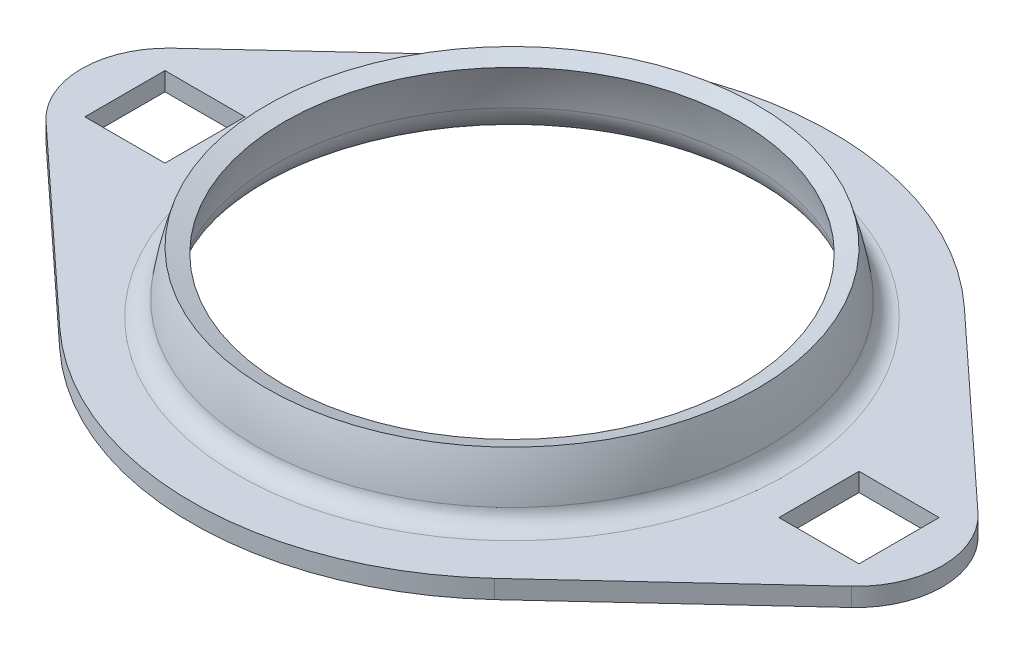
ISO-10303-21;
HEADER;
FILE_DESCRIPTION(('STEP AP214'),'2;1');
FILE_NAME('part.step','',(''),(''),'','','');
FILE_SCHEMA(('AUTOMOTIVE_DESIGN { 1 0 10303 214 1 1 1 1 }'));
ENDSEC;
DATA;
#1=APPLICATION_CONTEXT('core data for automotive mechanical design processes');
#2=APPLICATION_PROTOCOL_DEFINITION('international standard','automotive_design',2000,#1);
#3=PRODUCT_CONTEXT('',#1,'mechanical');
#4=PRODUCT('Part','Part','',(#3));
#5=PRODUCT_RELATED_PRODUCT_CATEGORY('part','',(#4));
#6=PRODUCT_DEFINITION_FORMATION('','',#4);
#7=PRODUCT_DEFINITION_CONTEXT('part definition',#1,'design');
#8=PRODUCT_DEFINITION('design','',#6,#7);
#9=PRODUCT_DEFINITION_SHAPE('','',#8);
#10=(LENGTH_UNIT() NAMED_UNIT(*) SI_UNIT(.MILLI.,.METRE.));
#11=(NAMED_UNIT(*) PLANE_ANGLE_UNIT() SI_UNIT($,.RADIAN.));
#12=(NAMED_UNIT(*) SI_UNIT($,.STERADIAN.) SOLID_ANGLE_UNIT());
#13=UNCERTAINTY_MEASURE_WITH_UNIT(LENGTH_MEASURE(1.E-05),#10,'distance_accuracy_value','');
#14=(GEOMETRIC_REPRESENTATION_CONTEXT(3) GLOBAL_UNCERTAINTY_ASSIGNED_CONTEXT((#13)) GLOBAL_UNIT_ASSIGNED_CONTEXT((#10,
#11,#12)) REPRESENTATION_CONTEXT('',''));
#15=CARTESIAN_POINT('',(0.,0.,0.));
#16=DIRECTION('',(0.,0.,1.));
#17=DIRECTION('',(1.,0.,0.));
#18=AXIS2_PLACEMENT_3D('',#15,#16,#17);
#19=CARTESIAN_POINT('',(34.75,10.5,0.));
#20=DIRECTION('',(0.,1.,0.));
#21=DIRECTION('',(0.,0.,1.));
#22=AXIS2_PLACEMENT_3D('',#19,#20,#21);
#23=PLANE('',#22);
#24=DIRECTION('',(0.,0.,1.));
#25=VECTOR('',#24,1.);
#26=CARTESIAN_POINT('',(-42.0249999999999,10.5,0.));
#27=LINE('',#26,#25);
#28=CARTESIAN_POINT('',(-42.0249999999999,10.5,-4.35));
#29=VERTEX_POINT('',#28);
#30=CARTESIAN_POINT('',(-42.0249999999999,10.5,4.35));
#31=VERTEX_POINT('',#30);
#32=EDGE_CURVE('E243',#29,#31,#27,.T.);
#33=ORIENTED_EDGE('',*,*,#32,.F.);
#34=DIRECTION('',(-1.,0.,0.));
#35=VECTOR('',#34,1.);
#36=CARTESIAN_POINT('',(34.75,10.5,-4.35000000000002));
#37=LINE('',#36,#35);
#38=CARTESIAN_POINT('',(-33.3249999999999,10.5,-4.35));
#39=VERTEX_POINT('',#38);
#40=EDGE_CURVE('E237',#39,#29,#37,.T.);
#41=ORIENTED_EDGE('',*,*,#40,.F.);
#42=DIRECTION('',(0.,0.,1.));
#43=VECTOR('',#42,1.);
#44=CARTESIAN_POINT('',(-33.3249999999999,10.5,0.));
#45=LINE('',#44,#43);
#46=CARTESIAN_POINT('',(-33.3249999999999,10.5,4.35));
#47=VERTEX_POINT('',#46);
#48=EDGE_CURVE('E182',#39,#47,#45,.T.);
#49=ORIENTED_EDGE('',*,*,#48,.T.);
#50=DIRECTION('',(-1.,0.,0.));
#51=VECTOR('',#50,1.);
#52=CARTESIAN_POINT('',(34.75,10.5,4.35));
#53=LINE('',#52,#51);
#54=EDGE_CURVE('E240',#47,#31,#53,.T.);
#55=ORIENTED_EDGE('',*,*,#54,.T.);
#56=EDGE_LOOP('',(#33,#41,#49,#55));
#57=FACE_BOUND('',#56,.T.);
#58=CARTESIAN_POINT('',(0.,10.5,0.));
#59=DIRECTION('',(0.,-1.,0.));
#60=DIRECTION('',(0.,0.,-1.));
#61=AXIS2_PLACEMENT_3D('',#58,#59,#60);
#62=CIRCLE('',#61,29.732137494637);
#63=CARTESIAN_POINT('',(0.,10.5,-29.732137494637));
#64=VERTEX_POINT('',#63);
#65=EDGE_CURVE('E297',#64,#64,#62,.T.);
#66=ORIENTED_EDGE('',*,*,#65,.T.);
#67=EDGE_LOOP('',(#66));
#68=FACE_BOUND('',#67,.T.);
#69=CARTESIAN_POINT('',(0.,10.5,0.));
#70=DIRECTION('',(0.,-1.,0.));
#71=DIRECTION('',(0.,0.,-1.));
#72=AXIS2_PLACEMENT_3D('',#69,#70,#71);
#73=CIRCLE('',#72,34.75);
#74=CARTESIAN_POINT('',(23.6149334236567,10.5,25.4930857174304));
#75=VERTEX_POINT('',#74);
#76=CARTESIAN_POINT('',(-23.6149334236569,10.5,25.4930857174304));
#77=VERTEX_POINT('',#76);
#78=EDGE_CURVE('E12',#75,#77,#73,.T.);
#79=ORIENTED_EDGE('',*,*,#78,.F.);
#80=DIRECTION('',(0.733613977480021,0.,-0.679566429457741));
#81=VECTOR('',#80,1.);
#82=CARTESIAN_POINT('',(23.6149334236567,10.5,25.4930857174304));
#83=LINE('',#82,#81);
#84=CARTESIAN_POINT('',(43.7277414164133,10.5,6.86204877759941));
#85=VERTEX_POINT('',#84);
#86=EDGE_CURVE('E258',#75,#85,#83,.T.);
#87=ORIENTED_EDGE('',*,*,#86,.T.);
#88=CARTESIAN_POINT('',(37.3712404094721,10.5,4.44089209850063E-13));
#89=DIRECTION('',(0.,1.,0.));
#90=DIRECTION('',(0.,0.,1.));
#91=AXIS2_PLACEMENT_3D('',#88,#89,#90);
#92=CIRCLE('',#91,9.35375959052785);
#93=CARTESIAN_POINT('',(43.7277414164133,10.5,-6.86204877759865));
#94=VERTEX_POINT('',#93);
#95=EDGE_CURVE('E277',#85,#94,#92,.T.);
#96=ORIENTED_EDGE('',*,*,#95,.T.);
#97=DIRECTION('',(0.733613977480009,0.,0.679566429457755));
#98=VECTOR('',#97,1.);
#99=CARTESIAN_POINT('',(23.6149334236571,10.5,-25.4930857174302));
#100=LINE('',#99,#98);
#101=CARTESIAN_POINT('',(23.6149334236571,10.5,-25.4930857174302));
#102=VERTEX_POINT('',#101);
#103=EDGE_CURVE('E254',#102,#94,#100,.T.);
#104=ORIENTED_EDGE('',*,*,#103,.F.);
#105=CARTESIAN_POINT('',(-23.6149334236569,10.5,-25.4930857174304));
#106=VERTEX_POINT('',#105);
#107=EDGE_CURVE('E72',#106,#102,#73,.T.);
#108=ORIENTED_EDGE('',*,*,#107,.F.);
#109=DIRECTION('',(-0.733613977480011,0.,0.679566429457752));
#110=VECTOR('',#109,1.);
#111=CARTESIAN_POINT('',(-23.6149334236569,10.5,-25.4930857174304));
#112=LINE('',#111,#110);
#113=CARTESIAN_POINT('',(-43.7277414164133,10.5,-6.86204877759888));
#114=VERTEX_POINT('',#113);
#115=EDGE_CURVE('E279',#106,#114,#112,.T.);
#116=ORIENTED_EDGE('',*,*,#115,.T.);
#117=CARTESIAN_POINT('',(-37.3712404094721,10.5,0.));
#118=DIRECTION('',(0.,1.,0.));
#119=DIRECTION('',(0.,0.,1.));
#120=AXIS2_PLACEMENT_3D('',#117,#118,#119);
#121=CIRCLE('',#120,9.35375959052777);
#122=CARTESIAN_POINT('',(-43.7277414164133,10.5,6.86204877759888));
#123=VERTEX_POINT('',#122);
#124=EDGE_CURVE('E263',#123,#114,#121,.F.);
#125=ORIENTED_EDGE('',*,*,#124,.F.);
#126=DIRECTION('',(-0.733613977480011,0.,-0.679566429457752));
#127=VECTOR('',#126,1.);
#128=CARTESIAN_POINT('',(-23.6149334236569,10.5,25.4930857174304));
#129=LINE('',#128,#127);
#130=EDGE_CURVE('E245',#77,#123,#129,.T.);
#131=ORIENTED_EDGE('',*,*,#130,.F.);
#132=EDGE_LOOP('',(#79,#87,#96,#104,#108,#116,#125,#131));
#133=FACE_BOUND('',#132,.T.);
#134=DIRECTION('',(1.,0.,0.));
#135=VECTOR('',#134,1.);
#136=CARTESIAN_POINT('',(34.75,10.5,-4.34999999999978));
#137=LINE('',#136,#135);
#138=CARTESIAN_POINT('',(33.3249999999999,10.5,-4.34999999999978));
#139=VERTEX_POINT('',#138);
#140=CARTESIAN_POINT('',(42.0249999999999,10.5,-4.34999999999978));
#141=VERTEX_POINT('',#140);
#142=EDGE_CURVE('E231',#139,#141,#137,.T.);
#143=ORIENTED_EDGE('',*,*,#142,.T.);
#144=DIRECTION('',(0.,0.,1.));
#145=VECTOR('',#144,1.);
#146=CARTESIAN_POINT('',(42.0249999999999,10.5,0.));
#147=LINE('',#146,#145);
#148=CARTESIAN_POINT('',(42.0249999999999,10.5,4.35000000000044));
#149=VERTEX_POINT('',#148);
#150=EDGE_CURVE('E234',#141,#149,#147,.T.);
#151=ORIENTED_EDGE('',*,*,#150,.T.);
#152=DIRECTION('',(1.,0.,0.));
#153=VECTOR('',#152,1.);
#154=CARTESIAN_POINT('',(34.75,10.5,4.35000000000044));
#155=LINE('',#154,#153);
#156=CARTESIAN_POINT('',(33.3249999999999,10.5,4.35000000000044));
#157=VERTEX_POINT('',#156);
#158=EDGE_CURVE('E206',#157,#149,#155,.T.);
#159=ORIENTED_EDGE('',*,*,#158,.F.);
#160=DIRECTION('',(0.,0.,1.));
#161=VECTOR('',#160,1.);
#162=CARTESIAN_POINT('',(33.3249999999999,10.5,0.));
#163=LINE('',#162,#161);
#164=EDGE_CURVE('E229',#139,#157,#163,.T.);
#165=ORIENTED_EDGE('',*,*,#164,.F.);
#166=EDGE_LOOP('',(#143,#151,#159,#165));
#167=FACE_BOUND('',#166,.T.);
#168=ADVANCED_FACE('F63',(#57,#68,#133,#167),#23,.T.);
#169=CARTESIAN_POINT('',(34.75,8.49999999999998,0.));
#170=DIRECTION('',(0.,1.,0.));
#171=DIRECTION('',(0.,0.,1.));
#172=AXIS2_PLACEMENT_3D('',#169,#170,#171);
#173=PLANE('',#172);
#174=DIRECTION('',(1.,0.,0.));
#175=VECTOR('',#174,1.);
#176=CARTESIAN_POINT('',(-42.0249999999999,8.49999999999998,-4.35));
#177=LINE('',#176,#175);
#178=CARTESIAN_POINT('',(-42.0249999999999,8.49999999999998,-4.35));
#179=VERTEX_POINT('',#178);
#180=CARTESIAN_POINT('',(-33.3249999999999,8.49999999999998,-4.35));
#181=VERTEX_POINT('',#180);
#182=EDGE_CURVE('E189',#179,#181,#177,.T.);
#183=ORIENTED_EDGE('',*,*,#182,.F.);
#184=DIRECTION('',(0.,0.,-1.));
#185=VECTOR('',#184,1.);
#186=CARTESIAN_POINT('',(-42.0249999999999,8.49999999999998,4.35));
#187=LINE('',#186,#185);
#188=CARTESIAN_POINT('',(-42.0249999999999,8.49999999999998,4.35));
#189=VERTEX_POINT('',#188);
#190=EDGE_CURVE('E194',#189,#179,#187,.T.);
#191=ORIENTED_EDGE('',*,*,#190,.F.);
#192=DIRECTION('',(1.,0.,0.));
#193=VECTOR('',#192,1.);
#194=CARTESIAN_POINT('',(-42.0249999999999,8.49999999999998,4.35));
#195=LINE('',#194,#193);
#196=CARTESIAN_POINT('',(-33.3249999999999,8.49999999999998,4.35));
#197=VERTEX_POINT('',#196);
#198=EDGE_CURVE('E199',#189,#197,#195,.T.);
#199=ORIENTED_EDGE('',*,*,#198,.T.);
#200=DIRECTION('',(0.,0.,-1.));
#201=VECTOR('',#200,1.);
#202=CARTESIAN_POINT('',(-33.3249999999999,8.49999999999998,4.35));
#203=LINE('',#202,#201);
#204=EDGE_CURVE('E179',#197,#181,#203,.T.);
#205=ORIENTED_EDGE('',*,*,#204,.T.);
#206=EDGE_LOOP('',(#183,#191,#199,#205));
#207=FACE_BOUND('',#206,.T.);
#208=CARTESIAN_POINT('',(0.,8.49999999999995,0.));
#209=DIRECTION('',(0.,-1.,0.));
#210=DIRECTION('',(0.,0.,-1.));
#211=AXIS2_PLACEMENT_3D('',#208,#209,#210);
#212=CIRCLE('',#211,34.75);
#213=CARTESIAN_POINT('',(-23.6149334236569,8.49999999999995,-25.4930857174304));
#214=VERTEX_POINT('',#213);
#215=CARTESIAN_POINT('',(23.6149334236571,8.49999999999995,-25.4930857174302));
#216=VERTEX_POINT('',#215);
#217=EDGE_CURVE('E67',#214,#216,#212,.T.);
#218=ORIENTED_EDGE('',*,*,#217,.T.);
#219=DIRECTION('',(0.733613977480009,0.,0.679566429457755));
#220=VECTOR('',#219,1.);
#221=CARTESIAN_POINT('',(23.6149334236571,8.49999999999998,-25.4930857174302));
#222=LINE('',#221,#220);
#223=CARTESIAN_POINT('',(43.7277414164133,8.49999999999998,-6.86204877759866));
#224=VERTEX_POINT('',#223);
#225=EDGE_CURVE('E255',#216,#224,#222,.T.);
#226=ORIENTED_EDGE('',*,*,#225,.T.);
#227=CARTESIAN_POINT('',(37.3712404094721,8.49999999999998,4.44089209850063E-13));
#228=DIRECTION('',(0.,1.,0.));
#229=DIRECTION('',(0.,0.,1.));
#230=AXIS2_PLACEMENT_3D('',#227,#228,#229);
#231=CIRCLE('',#230,9.35375959052785);
#232=CARTESIAN_POINT('',(43.7277414164133,8.49999999999998,6.86204877759941));
#233=VERTEX_POINT('',#232);
#234=EDGE_CURVE('E251',#233,#224,#231,.T.);
#235=ORIENTED_EDGE('',*,*,#234,.F.);
#236=DIRECTION('',(0.733613977480021,0.,-0.679566429457741));
#237=VECTOR('',#236,1.);
#238=CARTESIAN_POINT('',(23.6149334236567,8.49999999999998,25.4930857174304));
#239=LINE('',#238,#237);
#240=CARTESIAN_POINT('',(23.6149334236564,8.49999999999995,25.4930857174306));
#241=VERTEX_POINT('',#240);
#242=EDGE_CURVE('E246',#241,#233,#239,.T.);
#243=ORIENTED_EDGE('',*,*,#242,.F.);
#244=CARTESIAN_POINT('',(-23.6149334236569,8.49999999999995,25.4930857174304));
#245=VERTEX_POINT('',#244);
#246=EDGE_CURVE('E303',#241,#245,#212,.T.);
#247=ORIENTED_EDGE('',*,*,#246,.T.);
#248=DIRECTION('',(-0.733613977480011,0.,-0.679566429457752));
#249=VECTOR('',#248,1.);
#250=CARTESIAN_POINT('',(-23.6149334236569,8.49999999999998,25.4930857174304));
#251=LINE('',#250,#249);
#252=CARTESIAN_POINT('',(-43.7277414164133,8.49999999999998,6.86204877759888));
#253=VERTEX_POINT('',#252);
#254=EDGE_CURVE('E267',#245,#253,#251,.T.);
#255=ORIENTED_EDGE('',*,*,#254,.T.);
#256=CARTESIAN_POINT('',(-37.3712404094721,8.49999999999998,0.));
#257=DIRECTION('',(0.,-1.,0.));
#258=DIRECTION('',(0.,0.,-1.));
#259=AXIS2_PLACEMENT_3D('',#256,#257,#258);
#260=CIRCLE('',#259,9.35375959052777);
#261=CARTESIAN_POINT('',(-43.7277414164133,8.49999999999998,-6.86204877759888));
#262=VERTEX_POINT('',#261);
#263=EDGE_CURVE('E259',#253,#262,#260,.T.);
#264=ORIENTED_EDGE('',*,*,#263,.T.);
#265=DIRECTION('',(-0.733613977480011,0.,0.679566429457752));
#266=VECTOR('',#265,1.);
#267=CARTESIAN_POINT('',(-23.6149334236569,8.49999999999998,-25.4930857174304));
#268=LINE('',#267,#266);
#269=EDGE_CURVE('E260',#214,#262,#268,.T.);
#270=ORIENTED_EDGE('',*,*,#269,.F.);
#271=EDGE_LOOP('',(#218,#226,#235,#243,#247,#255,#264,#270));
#272=FACE_BOUND('',#271,.T.);
#273=CARTESIAN_POINT('',(0.,8.49999999999999,0.));
#274=DIRECTION('',(0.,-1.,0.));
#275=DIRECTION('',(0.,0.,-1.));
#276=AXIS2_PLACEMENT_3D('',#273,#274,#275);
#277=CIRCLE('',#276,29.732137494637);
#278=CARTESIAN_POINT('',(0.,8.49999999999999,-29.732137494637));
#279=VERTEX_POINT('',#278);
#280=EDGE_CURVE('E310',#279,#279,#277,.T.);
#281=ORIENTED_EDGE('',*,*,#280,.F.);
#282=EDGE_LOOP('',(#281));
#283=FACE_BOUND('',#282,.T.);
#284=DIRECTION('',(0.,0.,-1.));
#285=VECTOR('',#284,1.);
#286=CARTESIAN_POINT('',(42.0249999999999,8.49999999999998,4.35000000000044));
#287=LINE('',#286,#285);
#288=CARTESIAN_POINT('',(42.0249999999999,8.49999999999998,4.35000000000044));
#289=VERTEX_POINT('',#288);
#290=CARTESIAN_POINT('',(42.0249999999999,8.49999999999998,-4.34999999999978));
#291=VERTEX_POINT('',#290);
#292=EDGE_CURVE('E225',#289,#291,#287,.T.);
#293=ORIENTED_EDGE('',*,*,#292,.T.);
#294=DIRECTION('',(-1.,0.,0.));
#295=VECTOR('',#294,1.);
#296=CARTESIAN_POINT('',(42.0249999999999,8.49999999999998,-4.34999999999978));
#297=LINE('',#296,#295);
#298=CARTESIAN_POINT('',(33.3249999999999,8.49999999999998,-4.34999999999978));
#299=VERTEX_POINT('',#298);
#300=EDGE_CURVE('E222',#291,#299,#297,.T.);
#301=ORIENTED_EDGE('',*,*,#300,.T.);
#302=DIRECTION('',(0.,0.,-1.));
#303=VECTOR('',#302,1.);
#304=CARTESIAN_POINT('',(33.3249999999999,8.49999999999998,4.35000000000044));
#305=LINE('',#304,#303);
#306=CARTESIAN_POINT('',(33.3249999999999,8.49999999999998,4.35000000000044));
#307=VERTEX_POINT('',#306);
#308=EDGE_CURVE('E219',#307,#299,#305,.T.);
#309=ORIENTED_EDGE('',*,*,#308,.F.);
#310=DIRECTION('',(-1.,0.,0.));
#311=VECTOR('',#310,1.);
#312=CARTESIAN_POINT('',(42.0249999999999,8.49999999999998,4.35000000000044));
#313=LINE('',#312,#311);
#314=EDGE_CURVE('E217',#289,#307,#313,.T.);
#315=ORIENTED_EDGE('',*,*,#314,.F.);
#316=EDGE_LOOP('',(#293,#301,#309,#315));
#317=FACE_BOUND('',#316,.T.);
#318=ADVANCED_FACE('F196',(#207,#272,#283,#317),#173,.F.);
#319=CARTESIAN_POINT('',(0.,8.49999999999995,0.));
#320=DIRECTION('',(0.,1.,0.));
#321=DIRECTION('',(0.,0.,1.));
#322=AXIS2_PLACEMENT_3D('',#319,#320,#321);
#323=CYLINDRICAL_SURFACE('',#322,34.75);
#324=ORIENTED_EDGE('',*,*,#78,.T.);
#325=DIRECTION('',(0.,-1.,0.));
#326=VECTOR('',#325,1.);
#327=CARTESIAN_POINT('',(-23.6149334236568,126.960948390437,25.4930857174303));
#328=LINE('',#327,#326);
#329=EDGE_CURVE('E285',#77,#245,#328,.T.);
#330=ORIENTED_EDGE('',*,*,#329,.T.);
#331=ORIENTED_EDGE('',*,*,#246,.F.);
#332=DIRECTION('',(0.,-1.,0.));
#333=VECTOR('',#332,1.);
#334=CARTESIAN_POINT('',(23.6149334236567,126.960948390437,25.4930857174304));
#335=LINE('',#334,#333);
#336=EDGE_CURVE('E250',#75,#241,#335,.T.);
#337=ORIENTED_EDGE('',*,*,#336,.F.);
#338=EDGE_LOOP('',(#324,#330,#331,#337));
#339=FACE_BOUND('',#338,.T.);
#340=ADVANCED_FACE('F352',(#339),#323,.T.);
#341=ORIENTED_EDGE('',*,*,#107,.T.);
#342=DIRECTION('',(0.,-1.,0.));
#343=VECTOR('',#342,1.);
#344=CARTESIAN_POINT('',(23.6149334236571,126.960948390437,-25.4930857174302));
#345=LINE('',#344,#343);
#346=EDGE_CURVE('E291',#102,#216,#345,.T.);
#347=ORIENTED_EDGE('',*,*,#346,.T.);
#348=ORIENTED_EDGE('',*,*,#217,.F.);
#349=DIRECTION('',(0.,-1.,0.));
#350=VECTOR('',#349,1.);
#351=CARTESIAN_POINT('',(-23.6149334236569,126.960948390437,-25.4930857174304));
#352=LINE('',#351,#350);
#353=EDGE_CURVE('E264',#106,#214,#352,.T.);
#354=ORIENTED_EDGE('',*,*,#353,.F.);
#355=EDGE_LOOP('',(#341,#347,#348,#354));
#356=FACE_BOUND('',#355,.T.);
#357=ADVANCED_FACE('F339',(#356),#323,.T.);
#358=CARTESIAN_POINT('',(0.,16.5,0.));
#359=DIRECTION('',(0.,1.,0.));
#360=DIRECTION('',(0.,0.,1.));
#361=AXIS2_PLACEMENT_3D('',#358,#359,#360);
#362=CONICAL_SURFACE('',#361,24.7386337537059,1.25802960485335);
#363=CARTESIAN_POINT('',(0.,17.1153846153846,0.));
#364=DIRECTION('',(0.,-1.,0.));
#365=DIRECTION('',(0.,0.,-1.));
#366=AXIS2_PLACEMENT_3D('',#363,#364,#365);
#367=CIRCLE('',#366,26.6416055809141);
#368=CARTESIAN_POINT('',(26.6416055809141,17.1153846153846,0.));
#369=VERTEX_POINT('',#368);
#370=EDGE_CURVE('E300',#369,#369,#367,.T.);
#371=ORIENTED_EDGE('',*,*,#370,.F.);
#372=EDGE_LOOP('',(#371));
#373=FACE_BOUND('',#372,.T.);
#374=CARTESIAN_POINT('',(0.,16.5,0.));
#375=DIRECTION('',(0.,-1.,0.));
#376=DIRECTION('',(0.,0.,-1.));
#377=AXIS2_PLACEMENT_3D('',#374,#375,#376);
#378=CIRCLE('',#377,24.7386337537059);
#379=CARTESIAN_POINT('',(24.7386337537059,16.5,0.));
#380=VERTEX_POINT('',#379);
#381=EDGE_CURVE('E307',#380,#380,#378,.T.);
#382=ORIENTED_EDGE('',*,*,#381,.T.);
#383=EDGE_LOOP('',(#382));
#384=FACE_BOUND('',#383,.T.);
#385=ADVANCED_FACE('F65',(#373,#384),#362,.F.);
#386=CARTESIAN_POINT('',(0.,12.5,0.));
#387=DIRECTION('',(0.,-1.,0.));
#388=DIRECTION('',(0.,0.,-1.));
#389=AXIS2_PLACEMENT_3D('',#386,#387,#388);
#390=TOROIDAL_SURFACE('',#389,29.732137494637,2.);
#391=CARTESIAN_POINT('',(0.,12.2333333333333,0.));
#392=DIRECTION('',(0.,-1.,0.));
#393=DIRECTION('',(0.,0.,-1.));
#394=AXIS2_PLACEMENT_3D('',#391,#392,#393);
#395=CIRCLE('',#394,27.7499949949945);
#396=CARTESIAN_POINT('',(27.7499949949945,12.2333333333333,0.));
#397=VERTEX_POINT('',#396);
#398=EDGE_CURVE('E301',#397,#397,#395,.T.);
#399=ORIENTED_EDGE('',*,*,#398,.T.);
#400=EDGE_LOOP('',(#399));
#401=FACE_BOUND('',#400,.T.);
#402=ORIENTED_EDGE('',*,*,#65,.F.);
#403=EDGE_LOOP('',(#402));
#404=FACE_BOUND('',#403,.T.);
#405=ADVANCED_FACE('F400',(#401,#404),#390,.F.);
#406=CARTESIAN_POINT('',(0.,8.5,0.));
#407=DIRECTION('',(0.,-1.,0.));
#408=DIRECTION('',(1.,0.,0.));
#409=AXIS2_PLACEMENT_3D('',#406,#407,#408);
#410=SPHERICAL_SURFACE('',#409,28.);
#411=CARTESIAN_POINT('',(26.6416055809141,17.1153846153846,0.));
#412=CARTESIAN_POINT('',(26.6576728379628,17.0656993722769,0.));
#413=CARTESIAN_POINT('',(26.6736011012478,17.0159691812667,0.));
#414=CARTESIAN_POINT('',(26.7051791485745,16.9164204622886,0.));
#415=CARTESIAN_POINT('',(26.7208289326164,16.8666019343208,0.));
#416=CARTESIAN_POINT('',(26.7518495297415,16.7668781002746,0.));
#417=CARTESIAN_POINT('',(26.7672203428249,16.7169727941963,0.));
#418=CARTESIAN_POINT('',(26.7976825173857,16.6170769662338,0.));
#419=CARTESIAN_POINT('',(26.8127738788632,16.5670864443496,0.));
#420=CARTESIAN_POINT('',(26.8426766776867,16.4670217495486,0.));
#421=CARTESIAN_POINT('',(26.8574881150326,16.4169475766319,0.));
#422=CARTESIAN_POINT('',(26.8868306019973,16.316717147211,0.));
#423=CARTESIAN_POINT('',(26.901361651616,16.2665608907069,0.));
#424=CARTESIAN_POINT('',(26.9301429082623,16.1661678641114,0.));
#425=CARTESIAN_POINT('',(26.9443931152898,16.1159310940201,0.));
#426=CARTESIAN_POINT('',(26.9726122406928,16.0153786127745,0.));
#427=CARTESIAN_POINT('',(26.9865811590683,15.9650629016203,0.));
#428=CARTESIAN_POINT('',(27.014237269908,15.8643541132433,0.));
#429=CARTESIAN_POINT('',(27.0279244623723,15.8139610360205,0.));
#430=CARTESIAN_POINT('',(27.0550166929501,15.7130990929227,0.));
#431=CARTESIAN_POINT('',(27.0684217310635,15.6626302270477,0.));
#432=CARTESIAN_POINT('',(27.0949492333319,15.561618286434,0.));
#433=CARTESIAN_POINT('',(27.1080716974867,15.5110752116953,0.));
#434=CARTESIAN_POINT('',(27.1340336410754,15.4099164354658,0.));
#435=CARTESIAN_POINT('',(27.1468731205091,15.359300733975,0.));
#436=CARTESIAN_POINT('',(27.172268692751,15.2579982886262,0.));
#437=CARTESIAN_POINT('',(27.1848247855591,15.2073115447682,0.));
#438=CARTESIAN_POINT('',(27.2096531915159,15.1058686012936,0.));
#439=CARTESIAN_POINT('',(27.2219255046646,15.055112401677,0.));
#440=CARTESIAN_POINT('',(27.2461859671516,14.9535321354682,0.));
#441=CARTESIAN_POINT('',(27.2581741164899,14.9027080688759,0.));
#442=CARTESIAN_POINT('',(27.2818658761003,14.8009936596228,0.));
#443=CARTESIAN_POINT('',(27.2935694863723,14.7501033169619,0.));
#444=CARTESIAN_POINT('',(27.3166918015007,14.6482579485535,0.));
#445=CARTESIAN_POINT('',(27.3281105063572,14.597302922806,0.));
#446=CARTESIAN_POINT('',(27.3506626532236,14.4953297832306,0.));
#447=CARTESIAN_POINT('',(27.3617960952334,14.4443116694027,0.));
#448=CARTESIAN_POINT('',(27.3837773679049,14.3422139506482,0.));
#449=CARTESIAN_POINT('',(27.3946251985665,14.2911343457214,0.));
#450=CARTESIAN_POINT('',(27.41603490898,14.1889152436751,0.));
#451=CARTESIAN_POINT('',(27.4265967887319,14.1377757465556,0.));
#452=CARTESIAN_POINT('',(27.4474342667155,14.0354384609045,0.));
#453=CARTESIAN_POINT('',(27.4577098649472,13.984240672373,0.));
#454=CARTESIAN_POINT('',(27.4779744582412,13.8817884065036,0.));
#455=CARTESIAN_POINT('',(27.4879634533034,13.8305339291657,0.));
#456=CARTESIAN_POINT('',(27.5076545275805,13.7279698900635,0.));
#457=CARTESIAN_POINT('',(27.5173566067953,13.6766603282992,0.));
#458=CARTESIAN_POINT('',(27.5364735456808,13.5739877264485,0.));
#459=CARTESIAN_POINT('',(27.5458884053515,13.5226246863621,0.));
#460=CARTESIAN_POINT('',(27.5644306104423,13.4198467356454,0.));
#461=CARTESIAN_POINT('',(27.5735579558624,13.3684318250152,0.));
#462=CARTESIAN_POINT('',(27.5915248467463,13.2655517426128,0.));
#463=CARTESIAN_POINT('',(27.6003643922102,13.2140865708408,0.));
#464=CARTESIAN_POINT('',(27.6177554064814,13.1111075771297,0.));
#465=CARTESIAN_POINT('',(27.6263068752888,13.0595937551906,0.));
#466=CARTESIAN_POINT('',(27.6431214685769,12.956519073645,0.));
#467=CARTESIAN_POINT('',(27.6513845930575,12.9049582140385,0.));
#468=CARTESIAN_POINT('',(27.667622239001,12.8017910711232,0.));
#469=CARTESIAN_POINT('',(27.6755967604637,12.7501847878145,0.));
#470=CARTESIAN_POINT('',(27.6912569508885,12.6469284129064,0.));
#471=CARTESIAN_POINT('',(27.6989426198504,12.5952783213071,0.));
#472=CARTESIAN_POINT('',(27.7140248641819,12.4919359465096,0.));
#473=CARTESIAN_POINT('',(27.7214214395515,12.4402436633114,0.));
#474=CARTESIAN_POINT('',(27.7359252670828,12.3368185236688,0.));
#475=CARTESIAN_POINT('',(27.7430325192445,12.2850856672244,0.));
#476=CARTESIAN_POINT('',(27.7499949949945,12.2333333333333,0.));
#477=B_SPLINE_CURVE_WITH_KNOTS('',3,(#411,#412,#413,#414,#415,#416,#417,#418,#419,#420,#421,
#422,#423,#424,#425,#426,#427,#428,#429,#430,#431,#432,#433,#434,#435,#436,#437,#438,#439,#440,
#441,#442,#443,#444,#445,#446,#447,#448,#449,#450,#451,#452,#453,#454,#455,#456,#457,#458,#459,
#460,#461,#462,#463,#464,#465,#466,#467,#468,#469,#470,#471,#472,#473,#474,#475,#476),
.UNSPECIFIED.,.F.,.F.,(4,2,2,2,2,2,2,2,2,2,2,2,2,2,2,2,2,2,2,2,2,2,2,2,2,2,2,2,2,2,2,2,4),(0.,
0.156655536644874,0.313311073289746,0.469966609934623,0.626622146579498,0.783277683224373,
0.939933219869248,1.09658875651412,1.253244293159,1.40989982980387,1.56655536644875,
1.72321090309362,1.8798664397385,2.03652197638337,2.19317751302825,2.34983304967312,
2.506488586318,2.66314412296287,2.81979965960775,2.97645519625262,3.1331107328975,
3.28976626954237,3.44642180618725,3.60307734283212,3.759732879477,3.91638841612187,
4.07304395276675,4.22969948941162,4.3863550260565,4.54301056270137,4.69966609934625,
4.85632163599112,5.012977172636),.UNSPECIFIED.);
#478=EDGE_CURVE('BSEAM403',#369,#397,#477,.T.);
#479=ORIENTED_EDGE('',*,*,#370,.T.);
#480=ORIENTED_EDGE('',*,*,#398,.F.);
#481=ORIENTED_EDGE('',*,*,#478,.T.);
#482=ORIENTED_EDGE('',*,*,#478,.F.);
#483=EDGE_LOOP('',(#479,#481,#480,#482));
#484=FACE_BOUND('',#483,.T.);
#485=ADVANCED_FACE('F403',(#484),#410,.T.);
#486=CARTESIAN_POINT('',(0.,12.5,0.));
#487=DIRECTION('',(0.,-1.,0.));
#488=DIRECTION('',(0.,0.,-1.));
#489=AXIS2_PLACEMENT_3D('',#486,#487,#488);
#490=TOROIDAL_SURFACE('',#489,29.732137494637,4.);
#491=CARTESIAN_POINT('',(0.,11.9666666666667,0.));
#492=DIRECTION('',(0.,-1.,0.));
#493=DIRECTION('',(0.,0.,-1.));
#494=AXIS2_PLACEMENT_3D('',#491,#492,#493);
#495=CIRCLE('',#494,25.7678524953521);
#496=CARTESIAN_POINT('',(25.7678524953521,11.9666666666667,0.));
#497=VERTEX_POINT('',#496);
#498=EDGE_CURVE('E284',#497,#497,#495,.T.);
#499=ORIENTED_EDGE('',*,*,#498,.F.);
#500=EDGE_LOOP('',(#499));
#501=FACE_BOUND('',#500,.T.);
#502=ORIENTED_EDGE('',*,*,#280,.T.);
#503=EDGE_LOOP('',(#502));
#504=FACE_BOUND('',#503,.T.);
#505=ADVANCED_FACE('F407',(#501,#504),#490,.T.);
#506=CARTESIAN_POINT('',(0.,8.5,0.));
#507=DIRECTION('',(0.,-1.,0.));
#508=DIRECTION('',(1.,0.,0.));
#509=AXIS2_PLACEMENT_3D('',#506,#507,#508);
#510=SPHERICAL_SURFACE('',#509,26.);
#511=CARTESIAN_POINT('',(24.7386337537059,16.5,0.));
#512=CARTESIAN_POINT('',(24.7535533495369,16.4538637028285,0.));
#513=CARTESIAN_POINT('',(24.7683438797301,16.4076856683191,0.));
#514=CARTESIAN_POINT('',(24.7976663522478,16.3152475721252,0.));
#515=CARTESIAN_POINT('',(24.8121982945723,16.2689875104407,0.));
#516=CARTESIAN_POINT('',(24.84100313476,16.1763868073978,0.));
#517=CARTESIAN_POINT('',(24.8552760326231,16.1300461660394,0.));
#518=CARTESIAN_POINT('',(24.8835623375724,16.0372857543599,0.));
#519=CARTESIAN_POINT('',(24.8975757446587,15.9908659840389,0.));
#520=CARTESIAN_POINT('',(24.9253426292805,15.897948767438,0.));
#521=CARTESIAN_POINT('',(24.939096106816,15.8514513211582,0.));
#522=CARTESIAN_POINT('',(24.9663427018547,15.7583802081245,0.));
#523=CARTESIAN_POINT('',(24.9798358193578,15.7118065413707,0.));
#524=CARTESIAN_POINT('',(25.0065612719578,15.6185844452463,0.));
#525=CARTESIAN_POINT('',(25.0197936070548,15.5719360158758,0.));
#526=CARTESIAN_POINT('',(25.0459970806433,15.4785658547192,0.));
#527=CARTESIAN_POINT('',(25.0589682191348,15.4318441229331,0.));
#528=CARTESIAN_POINT('',(25.084648893486,15.3383288194402,0.));
#529=CARTESIAN_POINT('',(25.0973584293457,15.2915352477333,0.));
#530=CARTESIAN_POINT('',(25.1225155005965,15.1978777291425,0.));
#531=CARTESIAN_POINT('',(25.1349630359876,15.1510137822586,0.));
#532=CARTESIAN_POINT('',(25.1595957166653,15.0572169802601,0.));
#533=CARTESIAN_POINT('',(25.171780861952,15.0102841251456,0.));
#534=CARTESIAN_POINT('',(25.1958883809985,14.9163509757897,0.));
#535=CARTESIAN_POINT('',(25.2078107547585,14.8693506815482,0.));
#536=CARTESIAN_POINT('',(25.2313923575545,14.7752841251529,0.));
#537=CARTESIAN_POINT('',(25.2430515865906,14.728217862999,0.));
#538=CARTESIAN_POINT('',(25.2661065349791,14.6340208440583,0.));
#539=CARTESIAN_POINT('',(25.2775022543314,14.5868900872715,0.));
#540=CARTESIAN_POINT('',(25.3000298266408,14.4925655543633,0.));
#541=CARTESIAN_POINT('',(25.3111616795978,14.4453717782419,0.));
#542=CARTESIAN_POINT('',(25.3331611706645,14.3509226839354,0.));
#543=CARTESIAN_POINT('',(25.3440288087742,14.3036673657504,0.));
#544=CARTESIAN_POINT('',(25.365499529965,14.209096666514,0.));
#545=CARTESIAN_POINT('',(25.376102613046,14.1617812854627,0.));
#546=CARTESIAN_POINT('',(25.397043892279,14.0670919415712,0.));
#547=CARTESIAN_POINT('',(25.4073820884311,14.0197179787311,0.));
#548=CARTESIAN_POINT('',(25.4277932701974,13.9249129541733,0.));
#549=CARTESIAN_POINT('',(25.4378662558118,13.8774818924556,0.));
#550=CARTESIAN_POINT('',(25.4577467011957,13.7825641548412,0.));
#551=CARTESIAN_POINT('',(25.4675541609653,13.7350774789445,0.));
#552=CARTESIAN_POINT('',(25.4869032476644,13.6400499994113,0.));
#553=CARTESIAN_POINT('',(25.4964448745938,13.5925091957749,0.));
#554=CARTESIAN_POINT('',(25.5152619969382,13.4973749488962,0.));
#555=CARTESIAN_POINT('',(25.5245374923532,13.4497815056539,0.));
#556=CARTESIAN_POINT('',(25.5428220613247,13.3545434693447,0.));
#557=CARTESIAN_POINT('',(25.5518311348814,13.3068988762778,0.));
#558=CARTESIAN_POINT('',(25.5695825781322,13.2115600317022,0.));
#559=CARTESIAN_POINT('',(25.5783249478264,13.1638657801934,0.));
#560=CARTESIAN_POINT('',(25.5955427096964,13.0684291116708,0.));
#561=CARTESIAN_POINT('',(25.6040181018722,13.020686694657,0.));
#562=CARTESIAN_POINT('',(25.6207016434073,12.9251551895691,0.));
#563=CARTESIAN_POINT('',(25.6289097927666,12.877366101495,0.));
#564=CARTESIAN_POINT('',(25.6450585917327,12.7817427501918,0.));
#565=CARTESIAN_POINT('',(25.6529992413396,12.7339084869627,0.));
#566=CARTESIAN_POINT('',(25.6686127922499,12.6381962826704,0.));
#567=CARTESIAN_POINT('',(25.6762856935534,12.5903183416072,0.));
#568=CARTESIAN_POINT('',(25.6913635076437,12.4945202803287,0.));
#569=CARTESIAN_POINT('',(25.6987684204306,12.4466001601135,0.));
#570=CARTESIAN_POINT('',(25.713310025825,12.350719240556,0.));
#571=CARTESIAN_POINT('',(25.7204467184325,12.3027584412137,0.));
#572=CARTESIAN_POINT('',(25.7344516595975,12.206797664616,0.));
#573=CARTESIAN_POINT('',(25.7413199081549,12.1587976873606,0.));
#574=CARTESIAN_POINT('',(25.7547877480054,12.0627600576925,0.));
#575=CARTESIAN_POINT('',(25.7613873392985,12.0147224052798,0.));
#576=CARTESIAN_POINT('',(25.7678524953521,11.9666666666667,0.));
#577=B_SPLINE_CURVE_WITH_KNOTS('',3,(#511,#512,#513,#514,#515,#516,#517,#518,#519,#520,#521,
#522,#523,#524,#525,#526,#527,#528,#529,#530,#531,#532,#533,#534,#535,#536,#537,#538,#539,#540,
#541,#542,#543,#544,#545,#546,#547,#548,#549,#550,#551,#552,#553,#554,#555,#556,#557,#558,#559,
#560,#561,#562,#563,#564,#565,#566,#567,#568,#569,#570,#571,#572,#573,#574,#575,#576),
.UNSPECIFIED.,.F.,.F.,(4,2,2,2,2,2,2,2,2,2,2,2,2,2,2,2,2,2,2,2,2,2,2,2,2,2,2,2,2,2,2,2,4),(0.,
0.145465855455954,0.290931710911909,0.436397566367866,0.581863421823818,0.727329277279775,
0.872795132735731,1.01826098819168,1.16372684364764,1.3091926991036,1.45465855455955,
1.60012441001551,1.74559026547146,1.89105612092742,2.03652197638337,2.18198783183933,
2.32745368729528,2.47291954275124,2.61838539820719,2.76385125366315,2.9093171091191,
3.05478296457506,3.20024882003101,3.34571467548697,3.49118053094293,3.63664638639888,
3.78211224185484,3.92757809731079,4.07304395276675,4.2185098082227,4.36397566367866,
4.50944151913461,4.65490737459057),.UNSPECIFIED.);
#578=EDGE_CURVE('BSEAM395',#380,#497,#577,.T.);
#579=ORIENTED_EDGE('',*,*,#381,.F.);
#580=ORIENTED_EDGE('',*,*,#498,.T.);
#581=ORIENTED_EDGE('',*,*,#578,.T.);
#582=ORIENTED_EDGE('',*,*,#578,.F.);
#583=EDGE_LOOP('',(#579,#581,#580,#582));
#584=FACE_BOUND('',#583,.T.);
#585=ADVANCED_FACE('F395',(#584),#510,.F.);
#586=CARTESIAN_POINT('',(37.3712404094721,126.960948390437,4.44089209850063E-13));
#587=DIRECTION('',(0.,-1.,0.));
#588=DIRECTION('',(0.,0.,-1.));
#589=AXIS2_PLACEMENT_3D('',#586,#587,#588);
#590=CYLINDRICAL_SURFACE('',#589,9.35375959052785);
#591=ORIENTED_EDGE('',*,*,#95,.F.);
#592=DIRECTION('',(0.,-1.,0.));
#593=VECTOR('',#592,1.);
#594=CARTESIAN_POINT('',(43.7277414164133,126.960948390437,6.86204877759941));
#595=LINE('',#594,#593);
#596=EDGE_CURVE('E249',#85,#233,#595,.T.);
#597=ORIENTED_EDGE('',*,*,#596,.T.);
#598=ORIENTED_EDGE('',*,*,#234,.T.);
#599=DIRECTION('',(0.,-1.,0.));
#600=VECTOR('',#599,1.);
#601=CARTESIAN_POINT('',(43.7277414164133,126.960948390437,-6.86204877759866));
#602=LINE('',#601,#600);
#603=EDGE_CURVE('E282',#94,#224,#602,.T.);
#604=ORIENTED_EDGE('',*,*,#603,.F.);
#605=EDGE_LOOP('',(#591,#597,#598,#604));
#606=FACE_BOUND('',#605,.T.);
#607=ADVANCED_FACE('F347',(#606),#590,.T.);
#608=CARTESIAN_POINT('',(23.6149334236571,126.960948390437,-25.4930857174302));
#609=DIRECTION('',(0.679566429457755,0.,-0.733613977480008));
#610=DIRECTION('',(-0.733613977480009,0.,-0.679566429457755));
#611=AXIS2_PLACEMENT_3D('',#608,#609,#610);
#612=PLANE('',#611);
#613=ORIENTED_EDGE('',*,*,#346,.F.);
#614=ORIENTED_EDGE('',*,*,#103,.T.);
#615=ORIENTED_EDGE('',*,*,#603,.T.);
#616=ORIENTED_EDGE('',*,*,#225,.F.);
#617=EDGE_LOOP('',(#613,#614,#615,#616));
#618=FACE_BOUND('',#617,.T.);
#619=ADVANCED_FACE('F343',(#618),#612,.T.);
#620=CARTESIAN_POINT('',(23.6149334236567,126.960948390437,25.4930857174304));
#621=DIRECTION('',(-0.679566429457741,0.,-0.733613977480021));
#622=DIRECTION('',(-0.733613977480021,0.,0.679566429457741));
#623=AXIS2_PLACEMENT_3D('',#620,#621,#622);
#624=PLANE('',#623);
#625=ORIENTED_EDGE('',*,*,#86,.F.);
#626=ORIENTED_EDGE('',*,*,#336,.T.);
#627=ORIENTED_EDGE('',*,*,#242,.T.);
#628=ORIENTED_EDGE('',*,*,#596,.F.);
#629=EDGE_LOOP('',(#625,#626,#627,#628));
#630=FACE_BOUND('',#629,.T.);
#631=ADVANCED_FACE('F351',(#630),#624,.F.);
#632=CARTESIAN_POINT('',(-23.6149334236569,126.960948390437,25.4930857174304));
#633=DIRECTION('',(-0.679566429457752,0.,0.733613977480011));
#634=DIRECTION('',(0.733613977480011,0.,0.679566429457752));
#635=AXIS2_PLACEMENT_3D('',#632,#633,#634);
#636=PLANE('',#635);
#637=ORIENTED_EDGE('',*,*,#329,.F.);
#638=ORIENTED_EDGE('',*,*,#130,.T.);
#639=DIRECTION('',(0.,-1.,0.));
#640=VECTOR('',#639,1.);
#641=CARTESIAN_POINT('',(-43.7277414164133,126.960948390437,6.86204877759888));
#642=LINE('',#641,#640);
#643=EDGE_CURVE('E275',#123,#253,#642,.T.);
#644=ORIENTED_EDGE('',*,*,#643,.T.);
#645=ORIENTED_EDGE('',*,*,#254,.F.);
#646=EDGE_LOOP('',(#637,#638,#644,#645));
#647=FACE_BOUND('',#646,.T.);
#648=ADVANCED_FACE('F327',(#647),#636,.T.);
#649=CARTESIAN_POINT('',(-23.6149334236569,126.960948390437,-25.4930857174304));
#650=DIRECTION('',(0.679566429457752,0.,0.733613977480011));
#651=DIRECTION('',(0.733613977480011,0.,-0.679566429457752));
#652=AXIS2_PLACEMENT_3D('',#649,#650,#651);
#653=PLANE('',#652);
#654=ORIENTED_EDGE('',*,*,#115,.F.);
#655=ORIENTED_EDGE('',*,*,#353,.T.);
#656=ORIENTED_EDGE('',*,*,#269,.T.);
#657=DIRECTION('',(0.,-1.,0.));
#658=VECTOR('',#657,1.);
#659=CARTESIAN_POINT('',(-43.7277414164133,126.960948390437,-6.86204877759888));
#660=LINE('',#659,#658);
#661=EDGE_CURVE('E270',#114,#262,#660,.T.);
#662=ORIENTED_EDGE('',*,*,#661,.F.);
#663=EDGE_LOOP('',(#654,#655,#656,#662));
#664=FACE_BOUND('',#663,.T.);
#665=ADVANCED_FACE('F336',(#664),#653,.F.);
#666=CARTESIAN_POINT('',(-37.3712404094721,126.960948390437,0.));
#667=DIRECTION('',(0.,-1.,0.));
#668=DIRECTION('',(0.,0.,-1.));
#669=AXIS2_PLACEMENT_3D('',#666,#667,#668);
#670=CYLINDRICAL_SURFACE('',#669,9.35375959052777);
#671=ORIENTED_EDGE('',*,*,#643,.F.);
#672=ORIENTED_EDGE('',*,*,#124,.T.);
#673=ORIENTED_EDGE('',*,*,#661,.T.);
#674=ORIENTED_EDGE('',*,*,#263,.F.);
#675=EDGE_LOOP('',(#671,#672,#673,#674));
#676=FACE_BOUND('',#675,.T.);
#677=ADVANCED_FACE('F332',(#676),#670,.T.);
#678=CARTESIAN_POINT('',(42.0249999999999,17.1153846153846,4.35000000000044));
#679=DIRECTION('',(-1.,0.,0.));
#680=DIRECTION('',(0.,0.,1.));
#681=AXIS2_PLACEMENT_3D('',#678,#679,#680);
#682=PLANE('',#681);
#683=DIRECTION('',(0.,-1.,0.));
#684=VECTOR('',#683,1.);
#685=CARTESIAN_POINT('',(42.0249999999999,17.1153846153846,-4.34999999999978));
#686=LINE('',#685,#684);
#687=EDGE_CURVE('E209',#141,#291,#686,.T.);
#688=ORIENTED_EDGE('',*,*,#687,.T.);
#689=ORIENTED_EDGE('',*,*,#292,.F.);
#690=DIRECTION('',(0.,-1.,0.));
#691=VECTOR('',#690,1.);
#692=CARTESIAN_POINT('',(42.0249999999999,17.1153846153846,4.35000000000044));
#693=LINE('',#692,#691);
#694=EDGE_CURVE('E214',#149,#289,#693,.T.);
#695=ORIENTED_EDGE('',*,*,#694,.F.);
#696=ORIENTED_EDGE('',*,*,#150,.F.);
#697=EDGE_LOOP('',(#688,#689,#695,#696));
#698=FACE_BOUND('',#697,.T.);
#699=ADVANCED_FACE('F372',(#698),#682,.T.);
#700=CARTESIAN_POINT('',(42.0249999999999,17.1153846153846,-4.34999999999978));
#701=DIRECTION('',(0.,0.,1.));
#702=DIRECTION('',(1.,0.,0.));
#703=AXIS2_PLACEMENT_3D('',#700,#701,#702);
#704=PLANE('',#703);
#705=DIRECTION('',(0.,-1.,0.));
#706=VECTOR('',#705,1.);
#707=CARTESIAN_POINT('',(33.3249999999999,17.1153846153846,-4.34999999999978));
#708=LINE('',#707,#706);
#709=EDGE_CURVE('E211',#139,#299,#708,.T.);
#710=ORIENTED_EDGE('',*,*,#709,.T.);
#711=ORIENTED_EDGE('',*,*,#300,.F.);
#712=ORIENTED_EDGE('',*,*,#687,.F.);
#713=ORIENTED_EDGE('',*,*,#142,.F.);
#714=EDGE_LOOP('',(#710,#711,#712,#713));
#715=FACE_BOUND('',#714,.T.);
#716=ADVANCED_FACE('F363',(#715),#704,.T.);
#717=CARTESIAN_POINT('',(33.3249999999999,17.1153846153846,4.35000000000044));
#718=DIRECTION('',(-1.,0.,0.));
#719=DIRECTION('',(0.,0.,1.));
#720=AXIS2_PLACEMENT_3D('',#717,#718,#719);
#721=PLANE('',#720);
#722=ORIENTED_EDGE('',*,*,#164,.T.);
#723=DIRECTION('',(0.,-1.,0.));
#724=VECTOR('',#723,1.);
#725=CARTESIAN_POINT('',(33.3249999999999,17.1153846153846,4.35000000000044));
#726=LINE('',#725,#724);
#727=EDGE_CURVE('E88',#157,#307,#726,.T.);
#728=ORIENTED_EDGE('',*,*,#727,.T.);
#729=ORIENTED_EDGE('',*,*,#308,.T.);
#730=ORIENTED_EDGE('',*,*,#709,.F.);
#731=EDGE_LOOP('',(#722,#728,#729,#730));
#732=FACE_BOUND('',#731,.T.);
#733=ADVANCED_FACE('F366',(#732),#721,.F.);
#734=CARTESIAN_POINT('',(42.0249999999999,17.1153846153846,4.35000000000044));
#735=DIRECTION('',(0.,0.,1.));
#736=DIRECTION('',(1.,0.,0.));
#737=AXIS2_PLACEMENT_3D('',#734,#735,#736);
#738=PLANE('',#737);
#739=ORIENTED_EDGE('',*,*,#158,.T.);
#740=ORIENTED_EDGE('',*,*,#694,.T.);
#741=ORIENTED_EDGE('',*,*,#314,.T.);
#742=ORIENTED_EDGE('',*,*,#727,.F.);
#743=EDGE_LOOP('',(#739,#740,#741,#742));
#744=FACE_BOUND('',#743,.T.);
#745=ADVANCED_FACE('F373',(#744),#738,.F.);
#746=CARTESIAN_POINT('',(-42.0249999999999,17.1153846153846,4.35));
#747=DIRECTION('',(-1.,0.,0.));
#748=DIRECTION('',(0.,0.,1.));
#749=AXIS2_PLACEMENT_3D('',#746,#747,#748);
#750=PLANE('',#749);
#751=ORIENTED_EDGE('',*,*,#32,.T.);
#752=DIRECTION('',(0.,-1.,0.));
#753=VECTOR('',#752,1.);
#754=CARTESIAN_POINT('',(-42.0249999999999,17.1153846153846,4.35));
#755=LINE('',#754,#753);
#756=EDGE_CURVE('E204',#31,#189,#755,.T.);
#757=ORIENTED_EDGE('',*,*,#756,.T.);
#758=ORIENTED_EDGE('',*,*,#190,.T.);
#759=DIRECTION('',(0.,-1.,0.));
#760=VECTOR('',#759,1.);
#761=CARTESIAN_POINT('',(-42.0249999999999,17.1153846153846,-4.35));
#762=LINE('',#761,#760);
#763=EDGE_CURVE('E185',#29,#179,#762,.T.);
#764=ORIENTED_EDGE('',*,*,#763,.F.);
#765=EDGE_LOOP('',(#751,#757,#758,#764));
#766=FACE_BOUND('',#765,.T.);
#767=ADVANCED_FACE('F375',(#766),#750,.F.);
#768=CARTESIAN_POINT('',(-42.0249999999999,17.1153846153846,4.35));
#769=DIRECTION('',(0.,0.,-1.));
#770=DIRECTION('',(-1.,0.,0.));
#771=AXIS2_PLACEMENT_3D('',#768,#769,#770);
#772=PLANE('',#771);
#773=DIRECTION('',(0.,-1.,0.));
#774=VECTOR('',#773,1.);
#775=CARTESIAN_POINT('',(-33.3249999999999,17.1153846153846,4.35));
#776=LINE('',#775,#774);
#777=EDGE_CURVE('E184',#47,#197,#776,.T.);
#778=ORIENTED_EDGE('',*,*,#777,.T.);
#779=ORIENTED_EDGE('',*,*,#198,.F.);
#780=ORIENTED_EDGE('',*,*,#756,.F.);
#781=ORIENTED_EDGE('',*,*,#54,.F.);
#782=EDGE_LOOP('',(#778,#779,#780,#781));
#783=FACE_BOUND('',#782,.T.);
#784=ADVANCED_FACE('F381',(#783),#772,.T.);
#785=CARTESIAN_POINT('',(-33.3249999999999,17.1153846153846,4.35));
#786=DIRECTION('',(-1.,0.,0.));
#787=DIRECTION('',(0.,0.,1.));
#788=AXIS2_PLACEMENT_3D('',#785,#786,#787);
#789=PLANE('',#788);
#790=DIRECTION('',(0.,-1.,0.));
#791=VECTOR('',#790,1.);
#792=CARTESIAN_POINT('',(-33.3249999999999,17.1153846153846,-4.35));
#793=LINE('',#792,#791);
#794=EDGE_CURVE('E80',#39,#181,#793,.T.);
#795=ORIENTED_EDGE('',*,*,#794,.T.);
#796=ORIENTED_EDGE('',*,*,#204,.F.);
#797=ORIENTED_EDGE('',*,*,#777,.F.);
#798=ORIENTED_EDGE('',*,*,#48,.F.);
#799=EDGE_LOOP('',(#795,#796,#797,#798));
#800=FACE_BOUND('',#799,.T.);
#801=ADVANCED_FACE('F176',(#800),#789,.T.);
#802=CARTESIAN_POINT('',(-42.0249999999999,17.1153846153846,-4.35));
#803=DIRECTION('',(0.,0.,-1.));
#804=DIRECTION('',(-1.,0.,0.));
#805=AXIS2_PLACEMENT_3D('',#802,#803,#804);
#806=PLANE('',#805);
#807=ORIENTED_EDGE('',*,*,#40,.T.);
#808=ORIENTED_EDGE('',*,*,#763,.T.);
#809=ORIENTED_EDGE('',*,*,#182,.T.);
#810=ORIENTED_EDGE('',*,*,#794,.F.);
#811=EDGE_LOOP('',(#807,#808,#809,#810));
#812=FACE_BOUND('',#811,.T.);
#813=ADVANCED_FACE('F190',(#812),#806,.F.);
#814=CLOSED_SHELL('',(#168,#318,#340,#357,#385,#405,#485,#505,#585,#607,#619,#631,#648,#665,
#677,#699,#716,#733,#745,#767,#784,#801,#813));
#815=MANIFOLD_SOLID_BREP('B2',#814);
#816=ADVANCED_BREP_SHAPE_REPRESENTATION('',(#18,#815),#14);
#817=SHAPE_DEFINITION_REPRESENTATION(#9,#816);
ENDSEC;
END-ISO-10303-21;
